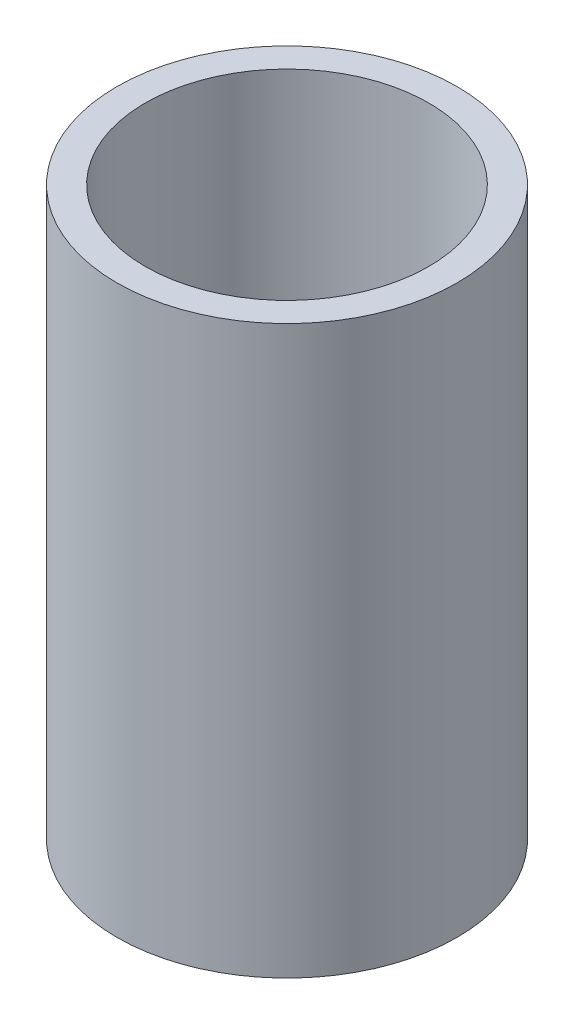
ISO-10303-21;
HEADER;
FILE_DESCRIPTION(('STEP AP214'),'2;1');
FILE_NAME('part.step','',(''),(''),'','','');
FILE_SCHEMA(('AUTOMOTIVE_DESIGN { 1 0 10303 214 1 1 1 1 }'));
ENDSEC;
DATA;
#1=APPLICATION_CONTEXT('core data for automotive mechanical design processes');
#2=APPLICATION_PROTOCOL_DEFINITION('international standard','automotive_design',2000,#1);
#3=PRODUCT_CONTEXT('',#1,'mechanical');
#4=PRODUCT('Part','Part','',(#3));
#5=PRODUCT_RELATED_PRODUCT_CATEGORY('part','',(#4));
#6=PRODUCT_DEFINITION_FORMATION('','',#4);
#7=PRODUCT_DEFINITION_CONTEXT('part definition',#1,'design');
#8=PRODUCT_DEFINITION('design','',#6,#7);
#9=PRODUCT_DEFINITION_SHAPE('','',#8);
#10=(LENGTH_UNIT() NAMED_UNIT(*) SI_UNIT(.MILLI.,.METRE.));
#11=(NAMED_UNIT(*) PLANE_ANGLE_UNIT() SI_UNIT($,.RADIAN.));
#12=(NAMED_UNIT(*) SI_UNIT($,.STERADIAN.) SOLID_ANGLE_UNIT());
#13=UNCERTAINTY_MEASURE_WITH_UNIT(LENGTH_MEASURE(1.E-05),#10,'distance_accuracy_value','');
#14=(GEOMETRIC_REPRESENTATION_CONTEXT(3) GLOBAL_UNCERTAINTY_ASSIGNED_CONTEXT((#13)) GLOBAL_UNIT_ASSIGNED_CONTEXT((#10,
#11,#12)) REPRESENTATION_CONTEXT('',''));
#15=CARTESIAN_POINT('',(0.,0.,0.));
#16=DIRECTION('',(0.,0.,1.));
#17=DIRECTION('',(1.,0.,0.));
#18=AXIS2_PLACEMENT_3D('',#15,#16,#17);
#19=CARTESIAN_POINT('',(0.,15.875,0.));
#20=DIRECTION('',(0.,1.,0.));
#21=DIRECTION('',(0.,0.,1.));
#22=AXIS2_PLACEMENT_3D('',#19,#20,#21);
#23=PLANE('',#22);
#24=CARTESIAN_POINT('',(0.,15.875,0.));
#25=DIRECTION('',(0.,1.,0.));
#26=DIRECTION('',(0.,0.,1.));
#27=AXIS2_PLACEMENT_3D('',#24,#25,#26);
#28=CIRCLE('',#27,4.7625);
#29=CARTESIAN_POINT('',(0.,15.875,4.7625));
#30=VERTEX_POINT('',#29);
#31=EDGE_CURVE('E10',#30,#30,#28,.T.);
#32=ORIENTED_EDGE('',*,*,#31,.T.);
#33=EDGE_LOOP('',(#32));
#34=FACE_BOUND('',#33,.T.);
#35=CARTESIAN_POINT('',(0.,15.875,0.));
#36=DIRECTION('',(0.,1.,0.));
#37=DIRECTION('',(0.,0.,1.));
#38=AXIS2_PLACEMENT_3D('',#35,#36,#37);
#39=CIRCLE('',#38,3.96875);
#40=CARTESIAN_POINT('',(0.,15.875,3.96875));
#41=VERTEX_POINT('',#40);
#42=EDGE_CURVE('E42',#41,#41,#39,.T.);
#43=ORIENTED_EDGE('',*,*,#42,.F.);
#44=EDGE_LOOP('',(#43));
#45=FACE_BOUND('',#44,.T.);
#46=ADVANCED_FACE('F31',(#34,#45),#23,.T.);
#47=CARTESIAN_POINT('',(0.,0.,0.));
#48=DIRECTION('',(0.,1.,0.));
#49=DIRECTION('',(0.,0.,1.));
#50=AXIS2_PLACEMENT_3D('',#47,#48,#49);
#51=PLANE('',#50);
#52=CARTESIAN_POINT('',(0.,0.,0.));
#53=DIRECTION('',(0.,1.,0.));
#54=DIRECTION('',(0.,0.,1.));
#55=AXIS2_PLACEMENT_3D('',#52,#53,#54);
#56=CIRCLE('',#55,4.7625);
#57=CARTESIAN_POINT('',(0.,0.,4.7625));
#58=VERTEX_POINT('',#57);
#59=EDGE_CURVE('E35',#58,#58,#56,.T.);
#60=ORIENTED_EDGE('',*,*,#59,.F.);
#61=EDGE_LOOP('',(#60));
#62=FACE_BOUND('',#61,.T.);
#63=CARTESIAN_POINT('',(0.,0.,0.));
#64=DIRECTION('',(0.,1.,0.));
#65=DIRECTION('',(0.,0.,1.));
#66=AXIS2_PLACEMENT_3D('',#63,#64,#65);
#67=CIRCLE('',#66,3.96875);
#68=CARTESIAN_POINT('',(0.,0.,3.96875));
#69=VERTEX_POINT('',#68);
#70=EDGE_CURVE('E44',#69,#69,#67,.T.);
#71=ORIENTED_EDGE('',*,*,#70,.T.);
#72=EDGE_LOOP('',(#71));
#73=FACE_BOUND('',#72,.T.);
#74=ADVANCED_FACE('F54',(#62,#73),#51,.F.);
#75=CARTESIAN_POINT('',(0.,15.875,0.));
#76=DIRECTION('',(0.,-1.,0.));
#77=DIRECTION('',(0.,0.,-1.));
#78=AXIS2_PLACEMENT_3D('',#75,#76,#77);
#79=CYLINDRICAL_SURFACE('',#78,4.7625);
#80=ORIENTED_EDGE('',*,*,#31,.F.);
#81=EDGE_LOOP('',(#80));
#82=FACE_BOUND('',#81,.T.);
#83=ORIENTED_EDGE('',*,*,#59,.T.);
#84=EDGE_LOOP('',(#83));
#85=FACE_BOUND('',#84,.T.);
#86=ADVANCED_FACE('F33',(#82,#85),#79,.T.);
#87=CARTESIAN_POINT('',(0.,15.875,0.));
#88=DIRECTION('',(0.,-1.,0.));
#89=DIRECTION('',(0.,0.,-1.));
#90=AXIS2_PLACEMENT_3D('',#87,#88,#89);
#91=CYLINDRICAL_SURFACE('',#90,3.96875);
#92=ORIENTED_EDGE('',*,*,#42,.T.);
#93=EDGE_LOOP('',(#92));
#94=FACE_BOUND('',#93,.T.);
#95=ORIENTED_EDGE('',*,*,#70,.F.);
#96=EDGE_LOOP('',(#95));
#97=FACE_BOUND('',#96,.T.);
#98=ADVANCED_FACE('F50',(#94,#97),#91,.F.);
#99=CLOSED_SHELL('',(#46,#74,#86,#98));
#100=MANIFOLD_SOLID_BREP('B2',#99);
#101=ADVANCED_BREP_SHAPE_REPRESENTATION('',(#18,#100),#14);
#102=SHAPE_DEFINITION_REPRESENTATION(#9,#101);
ENDSEC;
END-ISO-10303-21;
